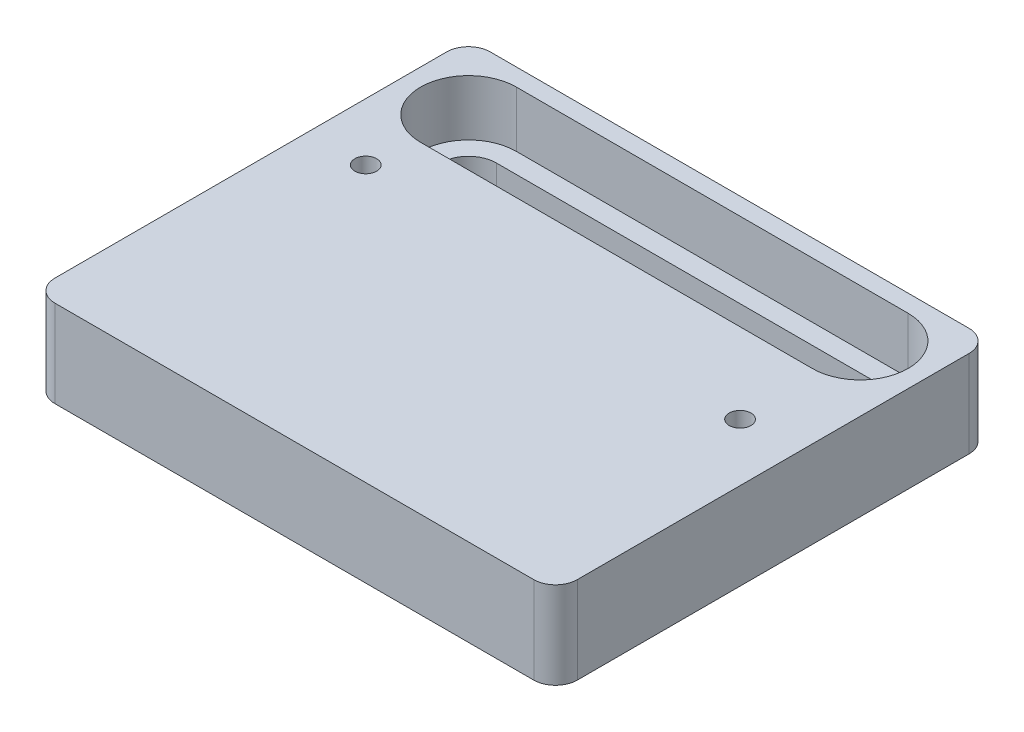
ISO-10303-21;
HEADER;
FILE_DESCRIPTION(('STEP AP214'),'2;1');
FILE_NAME('part.step','',(''),(''),'','','');
FILE_SCHEMA(('AUTOMOTIVE_DESIGN { 1 0 10303 214 1 1 1 1 }'));
ENDSEC;
DATA;
#1=APPLICATION_CONTEXT('core data for automotive mechanical design processes');
#2=APPLICATION_PROTOCOL_DEFINITION('international standard','automotive_design',2000,#1);
#3=PRODUCT_CONTEXT('',#1,'mechanical');
#4=PRODUCT('Part','Part','',(#3));
#5=PRODUCT_RELATED_PRODUCT_CATEGORY('part','',(#4));
#6=PRODUCT_DEFINITION_FORMATION('','',#4);
#7=PRODUCT_DEFINITION_CONTEXT('part definition',#1,'design');
#8=PRODUCT_DEFINITION('design','',#6,#7);
#9=PRODUCT_DEFINITION_SHAPE('','',#8);
#10=(LENGTH_UNIT() NAMED_UNIT(*) SI_UNIT(.MILLI.,.METRE.));
#11=(NAMED_UNIT(*) PLANE_ANGLE_UNIT() SI_UNIT($,.RADIAN.));
#12=(NAMED_UNIT(*) SI_UNIT($,.STERADIAN.) SOLID_ANGLE_UNIT());
#13=UNCERTAINTY_MEASURE_WITH_UNIT(LENGTH_MEASURE(1.E-05),#10,'distance_accuracy_value','');
#14=(GEOMETRIC_REPRESENTATION_CONTEXT(3) GLOBAL_UNCERTAINTY_ASSIGNED_CONTEXT((#13)) GLOBAL_UNIT_ASSIGNED_CONTEXT((#10,
#11,#12)) REPRESENTATION_CONTEXT('',''));
#15=CARTESIAN_POINT('',(0.,0.,0.));
#16=DIRECTION('',(0.,0.,1.));
#17=DIRECTION('',(1.,0.,0.));
#18=AXIS2_PLACEMENT_3D('',#15,#16,#17);
#19=CARTESIAN_POINT('',(30.,10.,-25.));
#20=DIRECTION('',(-1.,0.,0.));
#21=DIRECTION('',(0.,0.,1.));
#22=AXIS2_PLACEMENT_3D('',#19,#20,#21);
#23=PLANE('',#22);
#24=DIRECTION('',(0.,0.,-1.));
#25=VECTOR('',#24,1.);
#26=CARTESIAN_POINT('',(30.,0.,-25.));
#27=LINE('',#26,#25);
#28=CARTESIAN_POINT('',(30.,0.,22.5));
#29=VERTEX_POINT('',#28);
#30=CARTESIAN_POINT('',(30.,0.,-22.5));
#31=VERTEX_POINT('',#30);
#32=EDGE_CURVE('E234',#29,#31,#27,.T.);
#33=ORIENTED_EDGE('',*,*,#32,.T.);
#34=DIRECTION('',(0.,-1.,0.));
#35=VECTOR('',#34,1.);
#36=CARTESIAN_POINT('',(30.,10.,-22.5));
#37=LINE('',#36,#35);
#38=CARTESIAN_POINT('',(30.,10.,-22.5));
#39=VERTEX_POINT('',#38);
#40=EDGE_CURVE('E11',#31,#39,#37,.F.);
#41=ORIENTED_EDGE('',*,*,#40,.T.);
#42=DIRECTION('',(0.,0.,-1.));
#43=VECTOR('',#42,1.);
#44=CARTESIAN_POINT('',(30.,10.,-25.));
#45=LINE('',#44,#43);
#46=CARTESIAN_POINT('',(30.,10.,22.5));
#47=VERTEX_POINT('',#46);
#48=EDGE_CURVE('E235',#47,#39,#45,.T.);
#49=ORIENTED_EDGE('',*,*,#48,.F.);
#50=DIRECTION('',(0.,-1.,0.));
#51=VECTOR('',#50,1.);
#52=CARTESIAN_POINT('',(30.,10.,22.5));
#53=LINE('',#52,#51);
#54=EDGE_CURVE('E41',#47,#29,#53,.T.);
#55=ORIENTED_EDGE('',*,*,#54,.T.);
#56=EDGE_LOOP('',(#33,#41,#49,#55));
#57=FACE_BOUND('',#56,.T.);
#58=ADVANCED_FACE('F33',(#57),#23,.F.);
#59=CARTESIAN_POINT('',(-30.,10.,-25.));
#60=DIRECTION('',(0.,0.,1.));
#61=DIRECTION('',(1.,0.,0.));
#62=AXIS2_PLACEMENT_3D('',#59,#60,#61);
#63=PLANE('',#62);
#64=DIRECTION('',(-1.,0.,0.));
#65=VECTOR('',#64,1.);
#66=CARTESIAN_POINT('',(-30.,0.,-25.));
#67=LINE('',#66,#65);
#68=CARTESIAN_POINT('',(27.5,0.,-25.));
#69=VERTEX_POINT('',#68);
#70=CARTESIAN_POINT('',(-27.5,0.,-25.));
#71=VERTEX_POINT('',#70);
#72=EDGE_CURVE('E249',#69,#71,#67,.T.);
#73=ORIENTED_EDGE('',*,*,#72,.T.);
#74=DIRECTION('',(0.,-1.,0.));
#75=VECTOR('',#74,1.);
#76=CARTESIAN_POINT('',(-27.5,10.,-25.));
#77=LINE('',#76,#75);
#78=CARTESIAN_POINT('',(-27.5,10.,-25.));
#79=VERTEX_POINT('',#78);
#80=EDGE_CURVE('E271',#71,#79,#77,.F.);
#81=ORIENTED_EDGE('',*,*,#80,.T.);
#82=DIRECTION('',(-1.,0.,0.));
#83=VECTOR('',#82,1.);
#84=CARTESIAN_POINT('',(-30.,10.,-25.));
#85=LINE('',#84,#83);
#86=CARTESIAN_POINT('',(27.5,10.,-25.));
#87=VERTEX_POINT('',#86);
#88=EDGE_CURVE('E238',#87,#79,#85,.T.);
#89=ORIENTED_EDGE('',*,*,#88,.F.);
#90=DIRECTION('',(0.,-1.,0.));
#91=VECTOR('',#90,1.);
#92=CARTESIAN_POINT('',(27.5,10.,-25.));
#93=LINE('',#92,#91);
#94=EDGE_CURVE('E268',#87,#69,#93,.T.);
#95=ORIENTED_EDGE('',*,*,#94,.T.);
#96=EDGE_LOOP('',(#73,#81,#89,#95));
#97=FACE_BOUND('',#96,.T.);
#98=ADVANCED_FACE('F301',(#97),#63,.F.);
#99=CARTESIAN_POINT('',(-30.,10.,-25.));
#100=DIRECTION('',(1.,0.,0.));
#101=DIRECTION('',(0.,0.,-1.));
#102=AXIS2_PLACEMENT_3D('',#99,#100,#101);
#103=PLANE('',#102);
#104=DIRECTION('',(0.,0.,1.));
#105=VECTOR('',#104,1.);
#106=CARTESIAN_POINT('',(-30.,10.,-25.));
#107=LINE('',#106,#105);
#108=CARTESIAN_POINT('',(-30.,10.,-22.5));
#109=VERTEX_POINT('',#108);
#110=CARTESIAN_POINT('',(-30.,10.,22.5));
#111=VERTEX_POINT('',#110);
#112=EDGE_CURVE('E242',#109,#111,#107,.T.);
#113=ORIENTED_EDGE('',*,*,#112,.F.);
#114=DIRECTION('',(0.,-1.,0.));
#115=VECTOR('',#114,1.);
#116=CARTESIAN_POINT('',(-30.,10.,-22.5));
#117=LINE('',#116,#115);
#118=CARTESIAN_POINT('',(-30.,0.,-22.5));
#119=VERTEX_POINT('',#118);
#120=EDGE_CURVE('E257',#109,#119,#117,.T.);
#121=ORIENTED_EDGE('',*,*,#120,.T.);
#122=DIRECTION('',(0.,0.,1.));
#123=VECTOR('',#122,1.);
#124=CARTESIAN_POINT('',(-30.,0.,-25.));
#125=LINE('',#124,#123);
#126=CARTESIAN_POINT('',(-30.,0.,22.5));
#127=VERTEX_POINT('',#126);
#128=EDGE_CURVE('E252',#119,#127,#125,.T.);
#129=ORIENTED_EDGE('',*,*,#128,.T.);
#130=DIRECTION('',(0.,-1.,0.));
#131=VECTOR('',#130,1.);
#132=CARTESIAN_POINT('',(-30.,10.,22.5));
#133=LINE('',#132,#131);
#134=EDGE_CURVE('E246',#127,#111,#133,.F.);
#135=ORIENTED_EDGE('',*,*,#134,.T.);
#136=EDGE_LOOP('',(#113,#121,#129,#135));
#137=FACE_BOUND('',#136,.T.);
#138=ADVANCED_FACE('F310',(#137),#103,.F.);
#139=CARTESIAN_POINT('',(-30.,10.,25.));
#140=DIRECTION('',(0.,0.,-1.));
#141=DIRECTION('',(-1.,0.,0.));
#142=AXIS2_PLACEMENT_3D('',#139,#140,#141);
#143=PLANE('',#142);
#144=DIRECTION('',(1.,0.,0.));
#145=VECTOR('',#144,1.);
#146=CARTESIAN_POINT('',(-30.,10.,25.));
#147=LINE('',#146,#145);
#148=CARTESIAN_POINT('',(-27.5,10.,25.));
#149=VERTEX_POINT('',#148);
#150=CARTESIAN_POINT('',(27.5,10.,25.));
#151=VERTEX_POINT('',#150);
#152=EDGE_CURVE('E244',#149,#151,#147,.T.);
#153=ORIENTED_EDGE('',*,*,#152,.F.);
#154=DIRECTION('',(0.,-1.,0.));
#155=VECTOR('',#154,1.);
#156=CARTESIAN_POINT('',(-27.5,10.,25.));
#157=LINE('',#156,#155);
#158=CARTESIAN_POINT('',(-27.5,0.,25.));
#159=VERTEX_POINT('',#158);
#160=EDGE_CURVE('E281',#149,#159,#157,.T.);
#161=ORIENTED_EDGE('',*,*,#160,.T.);
#162=DIRECTION('',(1.,0.,0.));
#163=VECTOR('',#162,1.);
#164=CARTESIAN_POINT('',(-30.,0.,25.));
#165=LINE('',#164,#163);
#166=CARTESIAN_POINT('',(27.5,0.,25.));
#167=VERTEX_POINT('',#166);
#168=EDGE_CURVE('E239',#159,#167,#165,.T.);
#169=ORIENTED_EDGE('',*,*,#168,.T.);
#170=DIRECTION('',(0.,-1.,0.));
#171=VECTOR('',#170,1.);
#172=CARTESIAN_POINT('',(27.5,10.,25.));
#173=LINE('',#172,#171);
#174=EDGE_CURVE('E48',#167,#151,#173,.F.);
#175=ORIENTED_EDGE('',*,*,#174,.T.);
#176=EDGE_LOOP('',(#153,#161,#169,#175));
#177=FACE_BOUND('',#176,.T.);
#178=ADVANCED_FACE('F315',(#177),#143,.F.);
#179=CARTESIAN_POINT('',(0.,10.,0.));
#180=DIRECTION('',(0.,1.,0.));
#181=DIRECTION('',(0.,0.,1.));
#182=AXIS2_PLACEMENT_3D('',#179,#180,#181);
#183=PLANE('',#182);
#184=CARTESIAN_POINT('',(-22.5,10.,-17.5));
#185=DIRECTION('',(0.,1.,0.));
#186=DIRECTION('',(0.,0.,1.));
#187=AXIS2_PLACEMENT_3D('',#184,#185,#186);
#188=CIRCLE('',#187,5.5);
#189=CARTESIAN_POINT('',(-22.5,10.,-23.));
#190=VERTEX_POINT('',#189);
#191=CARTESIAN_POINT('',(-22.5,10.,-12.));
#192=VERTEX_POINT('',#191);
#193=EDGE_CURVE('E187',#190,#192,#188,.T.);
#194=ORIENTED_EDGE('',*,*,#193,.F.);
#195=DIRECTION('',(-1.,0.,0.));
#196=VECTOR('',#195,1.);
#197=CARTESIAN_POINT('',(-22.5,10.,-23.));
#198=LINE('',#197,#196);
#199=CARTESIAN_POINT('',(22.5,10.,-23.));
#200=VERTEX_POINT('',#199);
#201=EDGE_CURVE('E195',#200,#190,#198,.T.);
#202=ORIENTED_EDGE('',*,*,#201,.F.);
#203=CARTESIAN_POINT('',(22.5,10.,-17.5));
#204=DIRECTION('',(0.,1.,0.));
#205=DIRECTION('',(0.,0.,1.));
#206=AXIS2_PLACEMENT_3D('',#203,#204,#205);
#207=CIRCLE('',#206,5.5);
#208=CARTESIAN_POINT('',(22.5,10.,-12.));
#209=VERTEX_POINT('',#208);
#210=EDGE_CURVE('E209',#209,#200,#207,.T.);
#211=ORIENTED_EDGE('',*,*,#210,.F.);
#212=DIRECTION('',(1.,0.,0.));
#213=VECTOR('',#212,1.);
#214=CARTESIAN_POINT('',(-22.5,10.,-12.));
#215=LINE('',#214,#213);
#216=EDGE_CURVE('E206',#192,#209,#215,.T.);
#217=ORIENTED_EDGE('',*,*,#216,.F.);
#218=EDGE_LOOP('',(#194,#202,#211,#217));
#219=FACE_BOUND('',#218,.T.);
#220=CARTESIAN_POINT('',(-23.4,10.,-6.6));
#221=DIRECTION('',(0.,1.,0.));
#222=DIRECTION('',(0.,0.,1.));
#223=AXIS2_PLACEMENT_3D('',#220,#221,#222);
#224=CIRCLE('',#223,1.25);
#225=CARTESIAN_POINT('',(-23.4,10.,-5.35));
#226=VERTEX_POINT('',#225);
#227=EDGE_CURVE('E216',#226,#226,#224,.T.);
#228=ORIENTED_EDGE('',*,*,#227,.F.);
#229=EDGE_LOOP('',(#228));
#230=FACE_BOUND('',#229,.T.);
#231=CARTESIAN_POINT('',(23.4,10.,-2.80000000000001));
#232=DIRECTION('',(0.,1.,0.));
#233=DIRECTION('',(0.,0.,1.));
#234=AXIS2_PLACEMENT_3D('',#231,#232,#233);
#235=CIRCLE('',#234,1.25);
#236=CARTESIAN_POINT('',(23.4,10.,-1.55000000000001));
#237=VERTEX_POINT('',#236);
#238=EDGE_CURVE('E228',#237,#237,#235,.T.);
#239=ORIENTED_EDGE('',*,*,#238,.F.);
#240=EDGE_LOOP('',(#239));
#241=FACE_BOUND('',#240,.T.);
#242=ORIENTED_EDGE('',*,*,#88,.T.);
#243=CARTESIAN_POINT('',(-27.5,10.,-22.5));
#244=DIRECTION('',(0.,1.,0.));
#245=DIRECTION('',(0.,0.,1.));
#246=AXIS2_PLACEMENT_3D('',#243,#244,#245);
#247=CIRCLE('',#246,2.5);
#248=EDGE_CURVE('E278',#79,#109,#247,.T.);
#249=ORIENTED_EDGE('',*,*,#248,.T.);
#250=ORIENTED_EDGE('',*,*,#112,.T.);
#251=CARTESIAN_POINT('',(-27.5,10.,22.5));
#252=DIRECTION('',(0.,1.,0.));
#253=DIRECTION('',(0.,0.,1.));
#254=AXIS2_PLACEMENT_3D('',#251,#252,#253);
#255=CIRCLE('',#254,2.5);
#256=EDGE_CURVE('E55',#111,#149,#255,.T.);
#257=ORIENTED_EDGE('',*,*,#256,.T.);
#258=ORIENTED_EDGE('',*,*,#152,.T.);
#259=CARTESIAN_POINT('',(27.5,10.,22.5));
#260=DIRECTION('',(0.,1.,0.));
#261=DIRECTION('',(0.,0.,1.));
#262=AXIS2_PLACEMENT_3D('',#259,#260,#261);
#263=CIRCLE('',#262,2.5);
#264=EDGE_CURVE('E273',#151,#47,#263,.T.);
#265=ORIENTED_EDGE('',*,*,#264,.T.);
#266=ORIENTED_EDGE('',*,*,#48,.T.);
#267=CARTESIAN_POINT('',(27.5,10.,-22.5));
#268=DIRECTION('',(0.,1.,0.));
#269=DIRECTION('',(0.,0.,1.));
#270=AXIS2_PLACEMENT_3D('',#267,#268,#269);
#271=CIRCLE('',#270,2.5);
#272=EDGE_CURVE('E275',#39,#87,#271,.T.);
#273=ORIENTED_EDGE('',*,*,#272,.T.);
#274=EDGE_LOOP('',(#242,#249,#250,#257,#258,#265,#266,#273));
#275=FACE_BOUND('',#274,.T.);
#276=ADVANCED_FACE('F304',(#219,#230,#241,#275),#183,.T.);
#277=CARTESIAN_POINT('',(0.,0.,0.));
#278=DIRECTION('',(0.,1.,0.));
#279=DIRECTION('',(0.,0.,1.));
#280=AXIS2_PLACEMENT_3D('',#277,#278,#279);
#281=PLANE('',#280);
#282=DIRECTION('',(-1.,0.,0.));
#283=VECTOR('',#282,1.);
#284=CARTESIAN_POINT('',(-22.5,0.,-20.7));
#285=LINE('',#284,#283);
#286=CARTESIAN_POINT('',(22.5,0.,-20.7));
#287=VERTEX_POINT('',#286);
#288=CARTESIAN_POINT('',(-22.5,0.,-20.7));
#289=VERTEX_POINT('',#288);
#290=EDGE_CURVE('E159',#287,#289,#285,.T.);
#291=ORIENTED_EDGE('',*,*,#290,.T.);
#292=CARTESIAN_POINT('',(-22.5,0.,-17.5));
#293=DIRECTION('',(0.,1.,0.));
#294=DIRECTION('',(0.,0.,1.));
#295=AXIS2_PLACEMENT_3D('',#292,#293,#294);
#296=CIRCLE('',#295,3.2);
#297=CARTESIAN_POINT('',(-22.5,0.,-14.3));
#298=VERTEX_POINT('',#297);
#299=EDGE_CURVE('E151',#289,#298,#296,.T.);
#300=ORIENTED_EDGE('',*,*,#299,.T.);
#301=DIRECTION('',(1.,0.,0.));
#302=VECTOR('',#301,1.);
#303=CARTESIAN_POINT('',(-22.5,0.,-14.3));
#304=LINE('',#303,#302);
#305=CARTESIAN_POINT('',(22.5,0.,-14.3));
#306=VERTEX_POINT('',#305);
#307=EDGE_CURVE('E163',#298,#306,#304,.T.);
#308=ORIENTED_EDGE('',*,*,#307,.T.);
#309=CARTESIAN_POINT('',(22.5,0.,-17.5));
#310=DIRECTION('',(0.,1.,0.));
#311=DIRECTION('',(0.,0.,1.));
#312=AXIS2_PLACEMENT_3D('',#309,#310,#311);
#313=CIRCLE('',#312,3.2);
#314=EDGE_CURVE('E167',#306,#287,#313,.T.);
#315=ORIENTED_EDGE('',*,*,#314,.T.);
#316=EDGE_LOOP('',(#291,#300,#308,#315));
#317=FACE_BOUND('',#316,.T.);
#318=CARTESIAN_POINT('',(-23.4,0.,-6.6));
#319=DIRECTION('',(0.,1.,0.));
#320=DIRECTION('',(0.,0.,1.));
#321=AXIS2_PLACEMENT_3D('',#318,#319,#320);
#322=CIRCLE('',#321,1.25);
#323=CARTESIAN_POINT('',(-23.4,0.,-5.35));
#324=VERTEX_POINT('',#323);
#325=EDGE_CURVE('E225',#324,#324,#322,.T.);
#326=ORIENTED_EDGE('',*,*,#325,.T.);
#327=EDGE_LOOP('',(#326));
#328=FACE_BOUND('',#327,.T.);
#329=CARTESIAN_POINT('',(23.4,0.,-2.80000000000001));
#330=DIRECTION('',(0.,1.,0.));
#331=DIRECTION('',(0.,0.,1.));
#332=AXIS2_PLACEMENT_3D('',#329,#330,#331);
#333=CIRCLE('',#332,1.25);
#334=CARTESIAN_POINT('',(23.4,0.,-1.55000000000001));
#335=VERTEX_POINT('',#334);
#336=EDGE_CURVE('E231',#335,#335,#333,.T.);
#337=ORIENTED_EDGE('',*,*,#336,.T.);
#338=EDGE_LOOP('',(#337));
#339=FACE_BOUND('',#338,.T.);
#340=ORIENTED_EDGE('',*,*,#128,.F.);
#341=CARTESIAN_POINT('',(-27.5,0.,-22.5));
#342=DIRECTION('',(0.,1.,0.));
#343=DIRECTION('',(0.,0.,1.));
#344=AXIS2_PLACEMENT_3D('',#341,#342,#343);
#345=CIRCLE('',#344,2.5);
#346=EDGE_CURVE('E266',#119,#71,#345,.F.);
#347=ORIENTED_EDGE('',*,*,#346,.T.);
#348=ORIENTED_EDGE('',*,*,#72,.F.);
#349=CARTESIAN_POINT('',(27.5,0.,-22.5));
#350=DIRECTION('',(0.,1.,0.));
#351=DIRECTION('',(0.,0.,1.));
#352=AXIS2_PLACEMENT_3D('',#349,#350,#351);
#353=CIRCLE('',#352,2.5);
#354=EDGE_CURVE('E262',#69,#31,#353,.F.);
#355=ORIENTED_EDGE('',*,*,#354,.T.);
#356=ORIENTED_EDGE('',*,*,#32,.F.);
#357=CARTESIAN_POINT('',(27.5,0.,22.5));
#358=DIRECTION('',(0.,1.,0.));
#359=DIRECTION('',(0.,0.,1.));
#360=AXIS2_PLACEMENT_3D('',#357,#358,#359);
#361=CIRCLE('',#360,2.5);
#362=EDGE_CURVE('E260',#29,#167,#361,.F.);
#363=ORIENTED_EDGE('',*,*,#362,.T.);
#364=ORIENTED_EDGE('',*,*,#168,.F.);
#365=CARTESIAN_POINT('',(-27.5,0.,22.5));
#366=DIRECTION('',(0.,1.,0.));
#367=DIRECTION('',(0.,0.,1.));
#368=AXIS2_PLACEMENT_3D('',#365,#366,#367);
#369=CIRCLE('',#368,2.5);
#370=EDGE_CURVE('E264',#159,#127,#369,.F.);
#371=ORIENTED_EDGE('',*,*,#370,.T.);
#372=EDGE_LOOP('',(#340,#347,#348,#355,#356,#363,#364,#371));
#373=FACE_BOUND('',#372,.T.);
#374=ADVANCED_FACE('F169',(#317,#328,#339,#373),#281,.F.);
#375=CARTESIAN_POINT('',(23.4,10.,-2.80000000000001));
#376=DIRECTION('',(0.,1.,0.));
#377=DIRECTION('',(0.,0.,1.));
#378=AXIS2_PLACEMENT_3D('',#375,#376,#377);
#379=CYLINDRICAL_SURFACE('',#378,1.25);
#380=ORIENTED_EDGE('',*,*,#336,.F.);
#381=EDGE_LOOP('',(#380));
#382=FACE_BOUND('',#381,.T.);
#383=ORIENTED_EDGE('',*,*,#238,.T.);
#384=EDGE_LOOP('',(#383));
#385=FACE_BOUND('',#384,.T.);
#386=ADVANCED_FACE('F438',(#382,#385),#379,.F.);
#387=CARTESIAN_POINT('',(-23.4,10.,-6.6));
#388=DIRECTION('',(0.,1.,0.));
#389=DIRECTION('',(0.,0.,1.));
#390=AXIS2_PLACEMENT_3D('',#387,#388,#389);
#391=CYLINDRICAL_SURFACE('',#390,1.25);
#392=ORIENTED_EDGE('',*,*,#325,.F.);
#393=EDGE_LOOP('',(#392));
#394=FACE_BOUND('',#393,.T.);
#395=ORIENTED_EDGE('',*,*,#227,.T.);
#396=EDGE_LOOP('',(#395));
#397=FACE_BOUND('',#396,.T.);
#398=ADVANCED_FACE('F429',(#394,#397),#391,.F.);
#399=CARTESIAN_POINT('',(-22.5,3.6,-17.5));
#400=DIRECTION('',(0.,1.,0.));
#401=DIRECTION('',(0.,0.,1.));
#402=AXIS2_PLACEMENT_3D('',#399,#400,#401);
#403=CYLINDRICAL_SURFACE('',#402,5.5);
#404=ORIENTED_EDGE('',*,*,#193,.T.);
#405=DIRECTION('',(0.,1.,0.));
#406=VECTOR('',#405,1.);
#407=CARTESIAN_POINT('',(-22.5,3.6,-12.));
#408=LINE('',#407,#406);
#409=CARTESIAN_POINT('',(-22.5,3.6,-12.));
#410=VERTEX_POINT('',#409);
#411=EDGE_CURVE('E204',#410,#192,#408,.T.);
#412=ORIENTED_EDGE('',*,*,#411,.F.);
#413=CARTESIAN_POINT('',(-22.5,3.6,-17.5));
#414=DIRECTION('',(0.,1.,0.));
#415=DIRECTION('',(0.,0.,1.));
#416=AXIS2_PLACEMENT_3D('',#413,#414,#415);
#417=CIRCLE('',#416,5.5);
#418=CARTESIAN_POINT('',(-22.5,3.6,-23.));
#419=VERTEX_POINT('',#418);
#420=EDGE_CURVE('E191',#419,#410,#417,.T.);
#421=ORIENTED_EDGE('',*,*,#420,.F.);
#422=DIRECTION('',(0.,1.,0.));
#423=VECTOR('',#422,1.);
#424=CARTESIAN_POINT('',(-22.5,3.6,-23.));
#425=LINE('',#424,#423);
#426=EDGE_CURVE('E214',#419,#190,#425,.T.);
#427=ORIENTED_EDGE('',*,*,#426,.T.);
#428=EDGE_LOOP('',(#404,#412,#421,#427));
#429=FACE_BOUND('',#428,.T.);
#430=ADVANCED_FACE('F420',(#429),#403,.F.);
#431=CARTESIAN_POINT('',(-22.5,3.6,-23.));
#432=DIRECTION('',(0.,0.,-1.));
#433=DIRECTION('',(-1.,0.,0.));
#434=AXIS2_PLACEMENT_3D('',#431,#432,#433);
#435=PLANE('',#434);
#436=ORIENTED_EDGE('',*,*,#201,.T.);
#437=ORIENTED_EDGE('',*,*,#426,.F.);
#438=DIRECTION('',(-1.,0.,0.));
#439=VECTOR('',#438,1.);
#440=CARTESIAN_POINT('',(-22.5,3.6,-23.));
#441=LINE('',#440,#439);
#442=CARTESIAN_POINT('',(22.5,3.6,-23.));
#443=VERTEX_POINT('',#442);
#444=EDGE_CURVE('E201',#443,#419,#441,.T.);
#445=ORIENTED_EDGE('',*,*,#444,.F.);
#446=DIRECTION('',(0.,1.,0.));
#447=VECTOR('',#446,1.);
#448=CARTESIAN_POINT('',(22.5,3.6,-23.));
#449=LINE('',#448,#447);
#450=EDGE_CURVE('E217',#443,#200,#449,.T.);
#451=ORIENTED_EDGE('',*,*,#450,.T.);
#452=EDGE_LOOP('',(#436,#437,#445,#451));
#453=FACE_BOUND('',#452,.T.);
#454=ADVANCED_FACE('F411',(#453),#435,.F.);
#455=CARTESIAN_POINT('',(22.5,3.6,-17.5));
#456=DIRECTION('',(0.,1.,0.));
#457=DIRECTION('',(0.,0.,1.));
#458=AXIS2_PLACEMENT_3D('',#455,#456,#457);
#459=CYLINDRICAL_SURFACE('',#458,5.5);
#460=ORIENTED_EDGE('',*,*,#210,.T.);
#461=ORIENTED_EDGE('',*,*,#450,.F.);
#462=CARTESIAN_POINT('',(22.5,3.6,-17.5));
#463=DIRECTION('',(0.,1.,0.));
#464=DIRECTION('',(0.,0.,1.));
#465=AXIS2_PLACEMENT_3D('',#462,#463,#464);
#466=CIRCLE('',#465,5.5);
#467=CARTESIAN_POINT('',(22.5,3.6,-12.));
#468=VERTEX_POINT('',#467);
#469=EDGE_CURVE('E198',#468,#443,#466,.T.);
#470=ORIENTED_EDGE('',*,*,#469,.F.);
#471=DIRECTION('',(0.,1.,0.));
#472=VECTOR('',#471,1.);
#473=CARTESIAN_POINT('',(22.5,3.6,-12.));
#474=LINE('',#473,#472);
#475=EDGE_CURVE('E219',#468,#209,#474,.T.);
#476=ORIENTED_EDGE('',*,*,#475,.T.);
#477=EDGE_LOOP('',(#460,#461,#470,#476));
#478=FACE_BOUND('',#477,.T.);
#479=ADVANCED_FACE('F402',(#478),#459,.F.);
#480=CARTESIAN_POINT('',(-22.5,3.6,-12.));
#481=DIRECTION('',(0.,0.,1.));
#482=DIRECTION('',(1.,0.,0.));
#483=AXIS2_PLACEMENT_3D('',#480,#481,#482);
#484=PLANE('',#483);
#485=ORIENTED_EDGE('',*,*,#216,.T.);
#486=ORIENTED_EDGE('',*,*,#475,.F.);
#487=DIRECTION('',(1.,0.,0.));
#488=VECTOR('',#487,1.);
#489=CARTESIAN_POINT('',(-22.5,3.6,-12.));
#490=LINE('',#489,#488);
#491=EDGE_CURVE('E194',#410,#468,#490,.T.);
#492=ORIENTED_EDGE('',*,*,#491,.F.);
#493=ORIENTED_EDGE('',*,*,#411,.T.);
#494=EDGE_LOOP('',(#485,#486,#492,#493));
#495=FACE_BOUND('',#494,.T.);
#496=ADVANCED_FACE('F393',(#495),#484,.F.);
#497=CARTESIAN_POINT('',(-22.5,3.6,-17.5));
#498=DIRECTION('',(0.,1.,0.));
#499=DIRECTION('',(0.,0.,1.));
#500=AXIS2_PLACEMENT_3D('',#497,#498,#499);
#501=PLANE('',#500);
#502=CARTESIAN_POINT('',(-22.5,3.6,-17.5));
#503=DIRECTION('',(0.,1.,0.));
#504=DIRECTION('',(0.,0.,1.));
#505=AXIS2_PLACEMENT_3D('',#502,#503,#504);
#506=CIRCLE('',#505,3.2);
#507=CARTESIAN_POINT('',(-22.5,3.6,-20.7));
#508=VERTEX_POINT('',#507);
#509=CARTESIAN_POINT('',(-22.5,3.6,-14.3));
#510=VERTEX_POINT('',#509);
#511=EDGE_CURVE('E154',#508,#510,#506,.T.);
#512=ORIENTED_EDGE('',*,*,#511,.F.);
#513=DIRECTION('',(-1.,0.,0.));
#514=VECTOR('',#513,1.);
#515=CARTESIAN_POINT('',(-22.5,3.6,-20.7));
#516=LINE('',#515,#514);
#517=CARTESIAN_POINT('',(22.5,3.6,-20.7));
#518=VERTEX_POINT('',#517);
#519=EDGE_CURVE('E172',#518,#508,#516,.T.);
#520=ORIENTED_EDGE('',*,*,#519,.F.);
#521=CARTESIAN_POINT('',(22.5,3.6,-17.5));
#522=DIRECTION('',(0.,1.,0.));
#523=DIRECTION('',(0.,0.,1.));
#524=AXIS2_PLACEMENT_3D('',#521,#522,#523);
#525=CIRCLE('',#524,3.2);
#526=CARTESIAN_POINT('',(22.5,3.6,-14.3));
#527=VERTEX_POINT('',#526);
#528=EDGE_CURVE('E175',#527,#518,#525,.T.);
#529=ORIENTED_EDGE('',*,*,#528,.F.);
#530=DIRECTION('',(1.,0.,0.));
#531=VECTOR('',#530,1.);
#532=CARTESIAN_POINT('',(-22.5,3.6,-14.3));
#533=LINE('',#532,#531);
#534=EDGE_CURVE('E181',#510,#527,#533,.T.);
#535=ORIENTED_EDGE('',*,*,#534,.F.);
#536=EDGE_LOOP('',(#512,#520,#529,#535));
#537=FACE_BOUND('',#536,.T.);
#538=ORIENTED_EDGE('',*,*,#420,.T.);
#539=ORIENTED_EDGE('',*,*,#491,.T.);
#540=ORIENTED_EDGE('',*,*,#469,.T.);
#541=ORIENTED_EDGE('',*,*,#444,.T.);
#542=EDGE_LOOP('',(#538,#539,#540,#541));
#543=FACE_BOUND('',#542,.T.);
#544=ADVANCED_FACE('F385',(#537,#543),#501,.T.);
#545=CARTESIAN_POINT('',(-22.5,0.,-17.5));
#546=DIRECTION('',(0.,1.,0.));
#547=DIRECTION('',(0.,0.,1.));
#548=AXIS2_PLACEMENT_3D('',#545,#546,#547);
#549=CYLINDRICAL_SURFACE('',#548,3.2);
#550=ORIENTED_EDGE('',*,*,#511,.T.);
#551=DIRECTION('',(0.,1.,0.));
#552=VECTOR('',#551,1.);
#553=CARTESIAN_POINT('',(-22.5,0.,-14.3));
#554=LINE('',#553,#552);
#555=EDGE_CURVE('E147',#298,#510,#554,.T.);
#556=ORIENTED_EDGE('',*,*,#555,.F.);
#557=ORIENTED_EDGE('',*,*,#299,.F.);
#558=DIRECTION('',(0.,1.,0.));
#559=VECTOR('',#558,1.);
#560=CARTESIAN_POINT('',(-22.5,0.,-20.7));
#561=LINE('',#560,#559);
#562=EDGE_CURVE('E185',#289,#508,#561,.T.);
#563=ORIENTED_EDGE('',*,*,#562,.T.);
#564=EDGE_LOOP('',(#550,#556,#557,#563));
#565=FACE_BOUND('',#564,.T.);
#566=ADVANCED_FACE('F149',(#565),#549,.F.);
#567=CARTESIAN_POINT('',(-22.5,0.,-20.7));
#568=DIRECTION('',(0.,0.,-1.));
#569=DIRECTION('',(-1.,0.,0.));
#570=AXIS2_PLACEMENT_3D('',#567,#568,#569);
#571=PLANE('',#570);
#572=ORIENTED_EDGE('',*,*,#519,.T.);
#573=ORIENTED_EDGE('',*,*,#562,.F.);
#574=ORIENTED_EDGE('',*,*,#290,.F.);
#575=DIRECTION('',(0.,1.,0.));
#576=VECTOR('',#575,1.);
#577=CARTESIAN_POINT('',(22.5,0.,-20.7));
#578=LINE('',#577,#576);
#579=EDGE_CURVE('E188',#287,#518,#578,.T.);
#580=ORIENTED_EDGE('',*,*,#579,.T.);
#581=EDGE_LOOP('',(#572,#573,#574,#580));
#582=FACE_BOUND('',#581,.T.);
#583=ADVANCED_FACE('F368',(#582),#571,.F.);
#584=CARTESIAN_POINT('',(22.5,0.,-17.5));
#585=DIRECTION('',(0.,1.,0.));
#586=DIRECTION('',(0.,0.,1.));
#587=AXIS2_PLACEMENT_3D('',#584,#585,#586);
#588=CYLINDRICAL_SURFACE('',#587,3.2);
#589=ORIENTED_EDGE('',*,*,#528,.T.);
#590=ORIENTED_EDGE('',*,*,#579,.F.);
#591=ORIENTED_EDGE('',*,*,#314,.F.);
#592=DIRECTION('',(0.,1.,0.));
#593=VECTOR('',#592,1.);
#594=CARTESIAN_POINT('',(22.5,0.,-14.3));
#595=LINE('',#594,#593);
#596=EDGE_CURVE('E158',#306,#527,#595,.T.);
#597=ORIENTED_EDGE('',*,*,#596,.T.);
#598=EDGE_LOOP('',(#589,#590,#591,#597));
#599=FACE_BOUND('',#598,.T.);
#600=ADVANCED_FACE('F360',(#599),#588,.F.);
#601=CARTESIAN_POINT('',(-22.5,0.,-14.3));
#602=DIRECTION('',(0.,0.,1.));
#603=DIRECTION('',(1.,0.,0.));
#604=AXIS2_PLACEMENT_3D('',#601,#602,#603);
#605=PLANE('',#604);
#606=ORIENTED_EDGE('',*,*,#534,.T.);
#607=ORIENTED_EDGE('',*,*,#596,.F.);
#608=ORIENTED_EDGE('',*,*,#307,.F.);
#609=ORIENTED_EDGE('',*,*,#555,.T.);
#610=EDGE_LOOP('',(#606,#607,#608,#609));
#611=FACE_BOUND('',#610,.T.);
#612=ADVANCED_FACE('F164',(#611),#605,.F.);
#613=CARTESIAN_POINT('',(-27.5,10.,-22.5));
#614=DIRECTION('',(0.,-1.,0.));
#615=DIRECTION('',(0.,0.,-1.));
#616=AXIS2_PLACEMENT_3D('',#613,#614,#615);
#617=CYLINDRICAL_SURFACE('',#616,2.5);
#618=ORIENTED_EDGE('',*,*,#248,.F.);
#619=ORIENTED_EDGE('',*,*,#80,.F.);
#620=ORIENTED_EDGE('',*,*,#346,.F.);
#621=ORIENTED_EDGE('',*,*,#120,.F.);
#622=EDGE_LOOP('',(#618,#619,#620,#621));
#623=FACE_BOUND('',#622,.T.);
#624=ADVANCED_FACE('F308',(#623),#617,.T.);
#625=CARTESIAN_POINT('',(-27.5,10.,22.5));
#626=DIRECTION('',(0.,-1.,0.));
#627=DIRECTION('',(0.,0.,-1.));
#628=AXIS2_PLACEMENT_3D('',#625,#626,#627);
#629=CYLINDRICAL_SURFACE('',#628,2.5);
#630=ORIENTED_EDGE('',*,*,#256,.F.);
#631=ORIENTED_EDGE('',*,*,#134,.F.);
#632=ORIENTED_EDGE('',*,*,#370,.F.);
#633=ORIENTED_EDGE('',*,*,#160,.F.);
#634=EDGE_LOOP('',(#630,#631,#632,#633));
#635=FACE_BOUND('',#634,.T.);
#636=ADVANCED_FACE('F314',(#635),#629,.T.);
#637=CARTESIAN_POINT('',(27.5,10.,-22.5));
#638=DIRECTION('',(0.,-1.,0.));
#639=DIRECTION('',(0.,0.,-1.));
#640=AXIS2_PLACEMENT_3D('',#637,#638,#639);
#641=CYLINDRICAL_SURFACE('',#640,2.5);
#642=ORIENTED_EDGE('',*,*,#272,.F.);
#643=ORIENTED_EDGE('',*,*,#40,.F.);
#644=ORIENTED_EDGE('',*,*,#354,.F.);
#645=ORIENTED_EDGE('',*,*,#94,.F.);
#646=EDGE_LOOP('',(#642,#643,#644,#645));
#647=FACE_BOUND('',#646,.T.);
#648=ADVANCED_FACE('F298',(#647),#641,.T.);
#649=CARTESIAN_POINT('',(27.5,10.,22.5));
#650=DIRECTION('',(0.,-1.,0.));
#651=DIRECTION('',(0.,0.,-1.));
#652=AXIS2_PLACEMENT_3D('',#649,#650,#651);
#653=CYLINDRICAL_SURFACE('',#652,2.5);
#654=ORIENTED_EDGE('',*,*,#264,.F.);
#655=ORIENTED_EDGE('',*,*,#174,.F.);
#656=ORIENTED_EDGE('',*,*,#362,.F.);
#657=ORIENTED_EDGE('',*,*,#54,.F.);
#658=EDGE_LOOP('',(#654,#655,#656,#657));
#659=FACE_BOUND('',#658,.T.);
#660=ADVANCED_FACE('F35',(#659),#653,.T.);
#661=CLOSED_SHELL('',(#58,#98,#138,#178,#276,#374,#386,#398,#430,#454,#479,#496,#544,#566,#583,
#600,#612,#624,#636,#648,#660));
#662=MANIFOLD_SOLID_BREP('B2',#661);
#663=ADVANCED_BREP_SHAPE_REPRESENTATION('',(#18,#662),#14);
#664=SHAPE_DEFINITION_REPRESENTATION(#9,#663);
ENDSEC;
END-ISO-10303-21;
